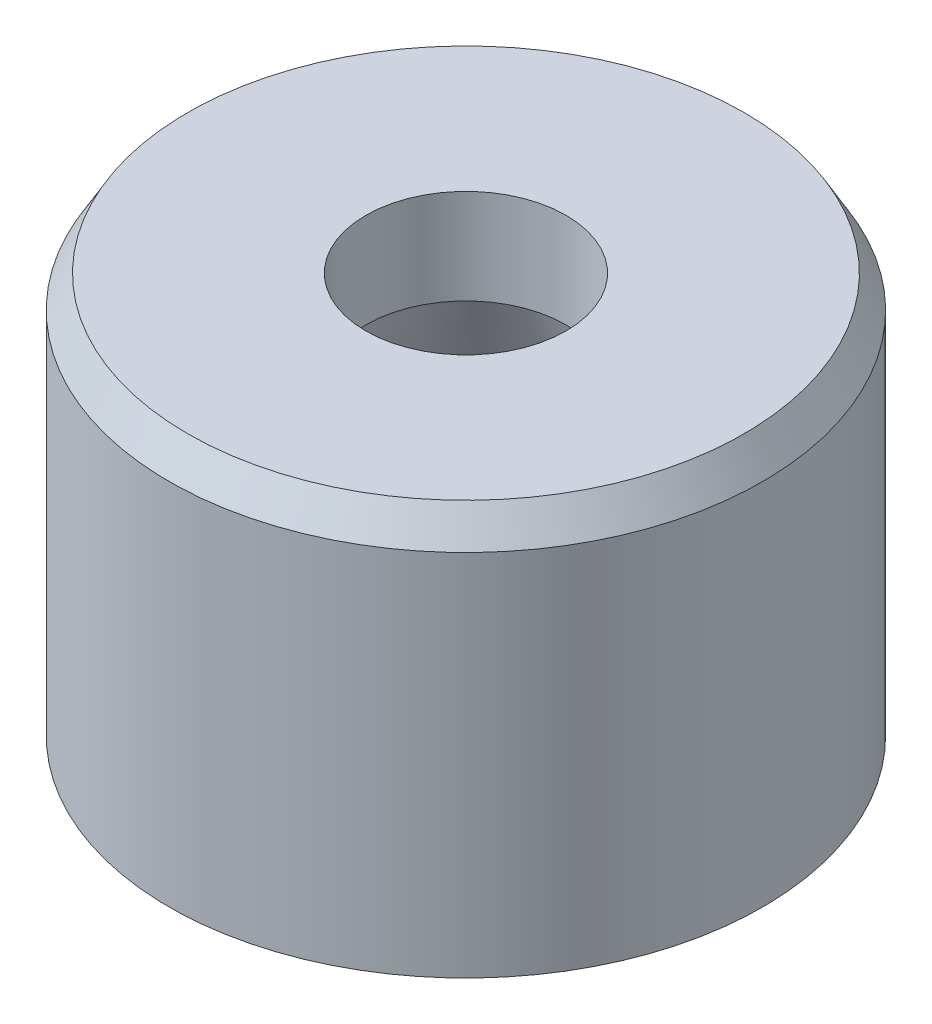
ISO-10303-21;
HEADER;
FILE_DESCRIPTION(('STEP AP214'),'2;1');
FILE_NAME('part.step','',(''),(''),'','','');
FILE_SCHEMA(('AUTOMOTIVE_DESIGN { 1 0 10303 214 1 1 1 1 }'));
ENDSEC;
DATA;
#1=APPLICATION_CONTEXT('core data for automotive mechanical design processes');
#2=APPLICATION_PROTOCOL_DEFINITION('international standard','automotive_design',2000,#1);
#3=PRODUCT_CONTEXT('',#1,'mechanical');
#4=PRODUCT('Part','Part','',(#3));
#5=PRODUCT_RELATED_PRODUCT_CATEGORY('part','',(#4));
#6=PRODUCT_DEFINITION_FORMATION('','',#4);
#7=PRODUCT_DEFINITION_CONTEXT('part definition',#1,'design');
#8=PRODUCT_DEFINITION('design','',#6,#7);
#9=PRODUCT_DEFINITION_SHAPE('','',#8);
#10=(LENGTH_UNIT() NAMED_UNIT(*) SI_UNIT(.MILLI.,.METRE.));
#11=(NAMED_UNIT(*) PLANE_ANGLE_UNIT() SI_UNIT($,.RADIAN.));
#12=(NAMED_UNIT(*) SI_UNIT($,.STERADIAN.) SOLID_ANGLE_UNIT());
#13=UNCERTAINTY_MEASURE_WITH_UNIT(LENGTH_MEASURE(1.E-05),#10,'distance_accuracy_value','');
#14=(GEOMETRIC_REPRESENTATION_CONTEXT(3) GLOBAL_UNCERTAINTY_ASSIGNED_CONTEXT((#13)) GLOBAL_UNIT_ASSIGNED_CONTEXT((#10,
#11,#12)) REPRESENTATION_CONTEXT('',''));
#15=CARTESIAN_POINT('',(0.,0.,0.));
#16=DIRECTION('',(0.,0.,1.));
#17=DIRECTION('',(1.,0.,0.));
#18=AXIS2_PLACEMENT_3D('',#15,#16,#17);
#19=CARTESIAN_POINT('',(0.,9.93397459621555,0.));
#20=DIRECTION('',(0.,-1.,0.));
#21=DIRECTION('',(0.,0.,-1.));
#22=AXIS2_PLACEMENT_3D('',#19,#20,#21);
#23=CONICAL_SURFACE('',#22,7.9999999999889,0.5235987755983);
#24=CARTESIAN_POINT('',(0.,10.8,0.));
#25=DIRECTION('',(0.,-1.,0.));
#26=DIRECTION('',(0.,0.,-1.));
#27=AXIS2_PLACEMENT_3D('',#24,#25,#26);
#28=CIRCLE('',#27,7.49999999998889);
#29=CARTESIAN_POINT('',(0.,10.8,-7.49999999998889));
#30=VERTEX_POINT('',#29);
#31=EDGE_CURVE('E10',#30,#30,#28,.T.);
#32=ORIENTED_EDGE('',*,*,#31,.T.);
#33=EDGE_LOOP('',(#32));
#34=FACE_BOUND('',#33,.T.);
#35=CARTESIAN_POINT('',(0.,9.93397459621555,0.));
#36=DIRECTION('',(0.,-1.,0.));
#37=DIRECTION('',(0.,0.,-1.));
#38=AXIS2_PLACEMENT_3D('',#35,#36,#37);
#39=CIRCLE('',#38,7.9999999999889);
#40=CARTESIAN_POINT('',(0.,9.93397459621555,-7.9999999999889));
#41=VERTEX_POINT('',#40);
#42=EDGE_CURVE('E58',#41,#41,#39,.T.);
#43=ORIENTED_EDGE('',*,*,#42,.F.);
#44=EDGE_LOOP('',(#43));
#45=FACE_BOUND('',#44,.T.);
#46=ADVANCED_FACE('F32',(#34,#45),#23,.T.);
#47=CARTESIAN_POINT('',(7.49999999998889,10.8,0.));
#48=DIRECTION('',(0.,1.,0.));
#49=DIRECTION('',(0.,0.,1.));
#50=AXIS2_PLACEMENT_3D('',#47,#48,#49);
#51=PLANE('',#50);
#52=CARTESIAN_POINT('',(0.,10.8,0.));
#53=DIRECTION('',(0.,-1.,0.));
#54=DIRECTION('',(0.,0.,-1.));
#55=AXIS2_PLACEMENT_3D('',#52,#53,#54);
#56=CIRCLE('',#55,2.6999999999889);
#57=CARTESIAN_POINT('',(0.,10.8,-2.6999999999889));
#58=VERTEX_POINT('',#57);
#59=EDGE_CURVE('E38',#58,#58,#56,.T.);
#60=ORIENTED_EDGE('',*,*,#59,.T.);
#61=EDGE_LOOP('',(#60));
#62=FACE_BOUND('',#61,.T.);
#63=ORIENTED_EDGE('',*,*,#31,.F.);
#64=EDGE_LOOP('',(#63));
#65=FACE_BOUND('',#64,.T.);
#66=ADVANCED_FACE('F66',(#62,#65),#51,.T.);
#67=CARTESIAN_POINT('',(0.,10.8,0.));
#68=DIRECTION('',(0.,-1.,0.));
#69=DIRECTION('',(0.,0.,-1.));
#70=AXIS2_PLACEMENT_3D('',#67,#68,#69);
#71=CYLINDRICAL_SURFACE('',#70,2.6999999999889);
#72=CARTESIAN_POINT('',(0.,8.24243225832788,0.));
#73=DIRECTION('',(0.,-1.,0.));
#74=DIRECTION('',(0.,0.,-1.));
#75=AXIS2_PLACEMENT_3D('',#72,#73,#74);
#76=CIRCLE('',#75,2.6999999999889);
#77=CARTESIAN_POINT('',(0.,8.24243225832788,-2.6999999999889));
#78=VERTEX_POINT('',#77);
#79=EDGE_CURVE('E43',#78,#78,#76,.T.);
#80=ORIENTED_EDGE('',*,*,#79,.T.);
#81=EDGE_LOOP('',(#80));
#82=FACE_BOUND('',#81,.T.);
#83=ORIENTED_EDGE('',*,*,#59,.F.);
#84=EDGE_LOOP('',(#83));
#85=FACE_BOUND('',#84,.T.);
#86=ADVANCED_FACE('F70',(#82,#85),#71,.F.);
#87=CARTESIAN_POINT('',(0.,8.24243225832788,0.));
#88=DIRECTION('',(0.,-1.,0.));
#89=DIRECTION('',(0.,0.,-1.));
#90=AXIS2_PLACEMENT_3D('',#87,#88,#89);
#91=CONICAL_SURFACE('',#90,2.6999999999889,0.349065850399587);
#92=CARTESIAN_POINT('',(0.,-5.6843418860808E-11,0.));
#93=DIRECTION('',(0.,-1.,0.));
#94=DIRECTION('',(0.,0.,-1.));
#95=AXIS2_PLACEMENT_3D('',#92,#93,#94);
#96=CIRCLE('',#95,5.70000000000323);
#97=CARTESIAN_POINT('',(0.,-5.6843418860808E-11,-5.70000000000323));
#98=VERTEX_POINT('',#97);
#99=EDGE_CURVE('E50',#98,#98,#96,.T.);
#100=ORIENTED_EDGE('',*,*,#99,.T.);
#101=EDGE_LOOP('',(#100));
#102=FACE_BOUND('',#101,.T.);
#103=ORIENTED_EDGE('',*,*,#79,.F.);
#104=EDGE_LOOP('',(#103));
#105=FACE_BOUND('',#104,.T.);
#106=ADVANCED_FACE('F74',(#102,#105),#91,.F.);
#107=CARTESIAN_POINT('',(5.70000000000323,-5.6843418860808E-11,0.));
#108=DIRECTION('',(0.,-1.,0.));
#109=DIRECTION('',(0.,0.,-1.));
#110=AXIS2_PLACEMENT_3D('',#107,#108,#109);
#111=PLANE('',#110);
#112=CARTESIAN_POINT('',(0.,-5.6843418860808E-11,0.));
#113=DIRECTION('',(0.,-1.,0.));
#114=DIRECTION('',(0.,0.,-1.));
#115=AXIS2_PLACEMENT_3D('',#112,#113,#114);
#116=CIRCLE('',#115,7.9999999999889);
#117=CARTESIAN_POINT('',(0.,-5.6843418860808E-11,-7.9999999999889));
#118=VERTEX_POINT('',#117);
#119=EDGE_CURVE('E55',#118,#118,#116,.T.);
#120=ORIENTED_EDGE('',*,*,#119,.T.);
#121=EDGE_LOOP('',(#120));
#122=FACE_BOUND('',#121,.T.);
#123=ORIENTED_EDGE('',*,*,#99,.F.);
#124=EDGE_LOOP('',(#123));
#125=FACE_BOUND('',#124,.T.);
#126=ADVANCED_FACE('F81',(#122,#125),#111,.T.);
#127=CARTESIAN_POINT('',(0.,10.8,0.));
#128=DIRECTION('',(0.,-1.,0.));
#129=DIRECTION('',(0.,0.,-1.));
#130=AXIS2_PLACEMENT_3D('',#127,#128,#129);
#131=CYLINDRICAL_SURFACE('',#130,7.9999999999889);
#132=ORIENTED_EDGE('',*,*,#42,.T.);
#133=EDGE_LOOP('',(#132));
#134=FACE_BOUND('',#133,.T.);
#135=ORIENTED_EDGE('',*,*,#119,.F.);
#136=EDGE_LOOP('',(#135));
#137=FACE_BOUND('',#136,.T.);
#138=ADVANCED_FACE('F62',(#134,#137),#131,.T.);
#139=CLOSED_SHELL('',(#46,#66,#86,#106,#126,#138));
#140=MANIFOLD_SOLID_BREP('B2',#139);
#141=ADVANCED_BREP_SHAPE_REPRESENTATION('',(#18,#140),#14);
#142=SHAPE_DEFINITION_REPRESENTATION(#9,#141);
ENDSEC;
END-ISO-10303-21;
